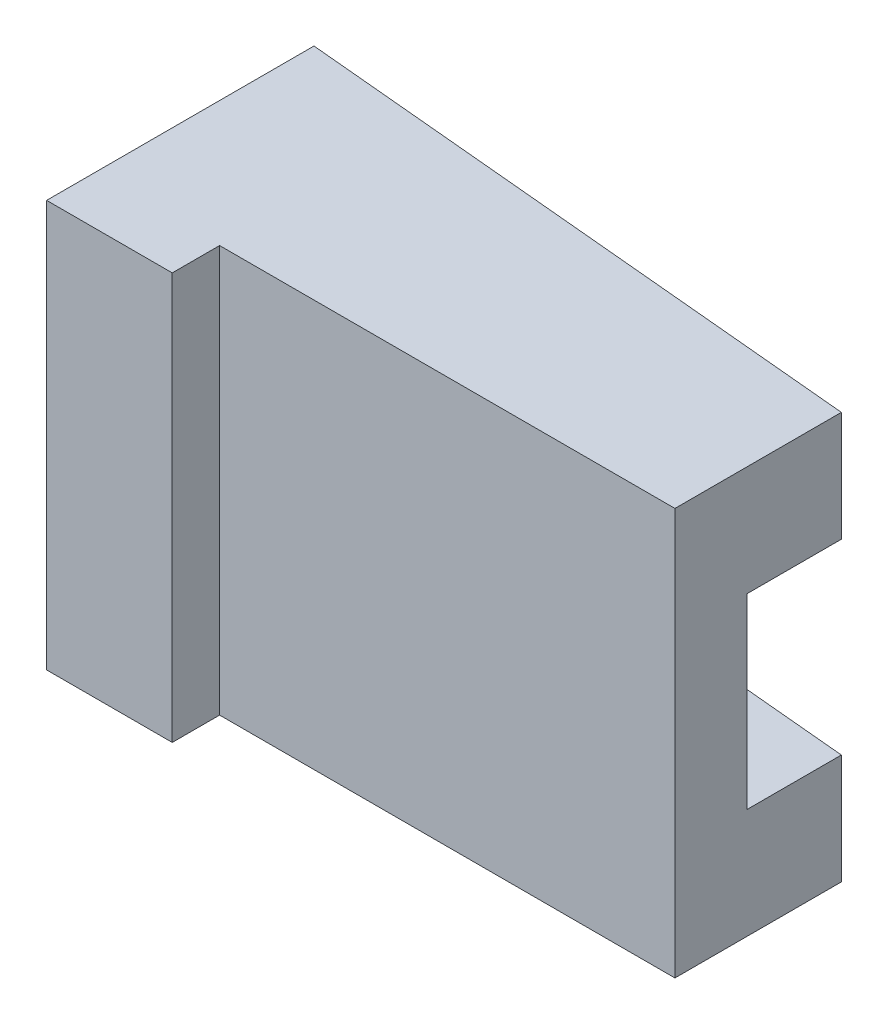
ISO-10303-21;
HEADER;
FILE_DESCRIPTION(('STEP AP214'),'2;1');
FILE_NAME('part.step','',(''),(''),'','','');
FILE_SCHEMA(('AUTOMOTIVE_DESIGN { 1 0 10303 214 1 1 1 1 }'));
ENDSEC;
DATA;
#1=APPLICATION_CONTEXT('core data for automotive mechanical design processes');
#2=APPLICATION_PROTOCOL_DEFINITION('international standard','automotive_design',2000,#1);
#3=PRODUCT_CONTEXT('',#1,'mechanical');
#4=PRODUCT('Part','Part','',(#3));
#5=PRODUCT_RELATED_PRODUCT_CATEGORY('part','',(#4));
#6=PRODUCT_DEFINITION_FORMATION('','',#4);
#7=PRODUCT_DEFINITION_CONTEXT('part definition',#1,'design');
#8=PRODUCT_DEFINITION('design','',#6,#7);
#9=PRODUCT_DEFINITION_SHAPE('','',#8);
#10=(LENGTH_UNIT() NAMED_UNIT(*) SI_UNIT(.MILLI.,.METRE.));
#11=(NAMED_UNIT(*) PLANE_ANGLE_UNIT() SI_UNIT($,.RADIAN.));
#12=(NAMED_UNIT(*) SI_UNIT($,.STERADIAN.) SOLID_ANGLE_UNIT());
#13=UNCERTAINTY_MEASURE_WITH_UNIT(LENGTH_MEASURE(1.E-05),#10,'distance_accuracy_value','');
#14=(GEOMETRIC_REPRESENTATION_CONTEXT(3) GLOBAL_UNCERTAINTY_ASSIGNED_CONTEXT((#13)) GLOBAL_UNIT_ASSIGNED_CONTEXT((#10,
#11,#12)) REPRESENTATION_CONTEXT('',''));
#15=CARTESIAN_POINT('',(0.,0.,0.));
#16=DIRECTION('',(0.,0.,1.));
#17=DIRECTION('',(1.,0.,0.));
#18=AXIS2_PLACEMENT_3D('',#15,#16,#17);
#19=CARTESIAN_POINT('',(-126.999964556229,-120.556177447376,-106.221518242105));
#20=DIRECTION('',(-1.,0.,0.));
#21=DIRECTION('',(0.,1.,0.));
#22=AXIS2_PLACEMENT_3D('',#19,#20,#21);
#23=CYLINDRICAL_SURFACE('',#22,2.05);
#24=CARTESIAN_POINT('',(-126.999964556229,-120.556177447376,-106.221518242105));
#25=DIRECTION('',(-1.,0.,0.));
#26=DIRECTION('',(0.,1.,0.));
#27=AXIS2_PLACEMENT_3D('',#24,#25,#26);
#28=CIRCLE('',#27,2.05);
#29=CARTESIAN_POINT('',(-126.999964556229,-122.606177447376,-106.221518242105));
#30=VERTEX_POINT('',#29);
#31=EDGE_CURVE('E205',#30,#30,#28,.T.);
#32=ORIENTED_EDGE('',*,*,#31,.T.);
#33=DIRECTION('',(1.,0.,0.));
#34=VECTOR('',#33,1.);
#35=CARTESIAN_POINT('',(-126.999964556229,-122.606177447376,-106.221518242105));
#36=LINE('',#35,#34);
#37=CARTESIAN_POINT('',(-115.999964556229,-122.606177447376,-106.221518242105));
#38=VERTEX_POINT('',#37);
#39=EDGE_CURVE('E11',#30,#38,#36,.T.);
#40=ORIENTED_EDGE('',*,*,#39,.T.);
#41=CARTESIAN_POINT('',(-115.999964556229,-120.556177447376,-106.221518242105));
#42=DIRECTION('',(-1.,0.,0.));
#43=DIRECTION('',(0.,1.,0.));
#44=AXIS2_PLACEMENT_3D('',#41,#42,#43);
#45=CIRCLE('',#44,2.05);
#46=EDGE_CURVE('E202',#38,#38,#45,.T.);
#47=ORIENTED_EDGE('',*,*,#46,.F.);
#48=ORIENTED_EDGE('',*,*,#39,.F.);
#49=EDGE_LOOP('',(#32,#40,#47,#48));
#50=FACE_BOUND('',#49,.T.);
#51=ADVANCED_FACE('F16',(#50),#23,.F.);
#52=CARTESIAN_POINT('',(-126.999964556229,-101.474691390343,-106.221518242105));
#53=DIRECTION('',(-1.,0.,0.));
#54=DIRECTION('',(0.,1.,0.));
#55=AXIS2_PLACEMENT_3D('',#52,#53,#54);
#56=CYLINDRICAL_SURFACE('',#55,2.05);
#57=CARTESIAN_POINT('',(-126.999964556229,-101.474691390343,-106.221518242105));
#58=DIRECTION('',(-1.,0.,0.));
#59=DIRECTION('',(0.,1.,0.));
#60=AXIS2_PLACEMENT_3D('',#57,#58,#59);
#61=CIRCLE('',#60,2.05);
#62=CARTESIAN_POINT('',(-126.999964556229,-103.524691390343,-106.221518242105));
#63=VERTEX_POINT('',#62);
#64=EDGE_CURVE('E208',#63,#63,#61,.T.);
#65=ORIENTED_EDGE('',*,*,#64,.T.);
#66=DIRECTION('',(1.,0.,0.));
#67=VECTOR('',#66,1.);
#68=CARTESIAN_POINT('',(-126.999964556229,-103.524691390343,-106.221518242105));
#69=LINE('',#68,#67);
#70=CARTESIAN_POINT('',(-115.999964556229,-103.524691390343,-106.221518242105));
#71=VERTEX_POINT('',#70);
#72=EDGE_CURVE('E27',#63,#71,#69,.T.);
#73=ORIENTED_EDGE('',*,*,#72,.T.);
#74=CARTESIAN_POINT('',(-115.999964556229,-101.474691390343,-106.221518242105));
#75=DIRECTION('',(-1.,0.,0.));
#76=DIRECTION('',(0.,1.,0.));
#77=AXIS2_PLACEMENT_3D('',#74,#75,#76);
#78=CIRCLE('',#77,2.05);
#79=EDGE_CURVE('E275',#71,#71,#78,.T.);
#80=ORIENTED_EDGE('',*,*,#79,.F.);
#81=ORIENTED_EDGE('',*,*,#72,.F.);
#82=EDGE_LOOP('',(#65,#73,#80,#81));
#83=FACE_BOUND('',#82,.T.);
#84=ADVANCED_FACE('F345',(#83),#56,.F.);
#85=CARTESIAN_POINT('',(-89.99996276809,-111.050046491209,-108.416206636852));
#86=DIRECTION('',(-1.,0.,0.));
#87=DIRECTION('',(0.,0.,1.));
#88=AXIS2_PLACEMENT_3D('',#85,#86,#87);
#89=PLANE('',#88);
#90=DIRECTION('',(0.,-1.,0.));
#91=VECTOR('',#90,1.);
#92=CARTESIAN_POINT('',(-89.99996276809,-124.000037425625,-110.916206636852));
#93=LINE('',#92,#91);
#94=CARTESIAN_POINT('',(-89.99996276809,-117.000055556792,-110.916206636852));
#95=VERTEX_POINT('',#94);
#96=CARTESIAN_POINT('',(-89.99996276809,-124.000037425625,-110.916206636852));
#97=VERTEX_POINT('',#96);
#98=EDGE_CURVE('E326',#95,#97,#93,.T.);
#99=ORIENTED_EDGE('',*,*,#98,.F.);
#100=DIRECTION('',(0.,0.,1.));
#101=VECTOR('',#100,1.);
#102=CARTESIAN_POINT('',(-89.99996276809,-117.000055556792,-111.800079289667));
#103=LINE('',#102,#101);
#104=CARTESIAN_POINT('',(-89.99996276809,-117.000055556792,-104.916206636852));
#105=VERTEX_POINT('',#104);
#106=EDGE_CURVE('E220',#95,#105,#103,.T.);
#107=ORIENTED_EDGE('',*,*,#106,.T.);
#108=DIRECTION('',(0.,-1.,0.));
#109=VECTOR('',#108,1.);
#110=CARTESIAN_POINT('',(-89.99996276809,-114.025051024,-104.916206636853));
#111=LINE('',#110,#109);
#112=CARTESIAN_POINT('',(-89.99996276809,-105.100055556792,-104.916206636852));
#113=VERTEX_POINT('',#112);
#114=EDGE_CURVE('E237',#113,#105,#111,.T.);
#115=ORIENTED_EDGE('',*,*,#114,.F.);
#116=DIRECTION('',(0.,0.,-1.));
#117=VECTOR('',#116,1.);
#118=CARTESIAN_POINT('',(-89.99996276809,-105.100055556792,-109.666206636853));
#119=LINE('',#118,#117);
#120=CARTESIAN_POINT('',(-89.99996276809,-105.100055556792,-110.916206636852));
#121=VERTEX_POINT('',#120);
#122=EDGE_CURVE('E212',#113,#121,#119,.T.);
#123=ORIENTED_EDGE('',*,*,#122,.T.);
#124=DIRECTION('',(0.,-1.,0.));
#125=VECTOR('',#124,1.);
#126=CARTESIAN_POINT('',(-89.99996276809,-104.100055556792,-110.916206636852));
#127=LINE('',#126,#125);
#128=CARTESIAN_POINT('',(-89.99996276809,-98.1000555567923,-110.916206636852));
#129=VERTEX_POINT('',#128);
#130=EDGE_CURVE('E209',#129,#121,#127,.T.);
#131=ORIENTED_EDGE('',*,*,#130,.F.);
#132=DIRECTION('',(0.,0.,1.));
#133=VECTOR('',#132,1.);
#134=CARTESIAN_POINT('',(-89.99996276809,-98.1000555567923,-105.916206636852));
#135=LINE('',#134,#133);
#136=CARTESIAN_POINT('',(-89.99996276809,-98.1000555567923,-100.316206636852));
#137=VERTEX_POINT('',#136);
#138=EDGE_CURVE('E188',#129,#137,#135,.T.);
#139=ORIENTED_EDGE('',*,*,#138,.T.);
#140=DIRECTION('',(0.,-1.,0.));
#141=VECTOR('',#140,1.);
#142=CARTESIAN_POINT('',(-89.99996276809,-98.1000555567923,-100.316206636852));
#143=LINE('',#142,#141);
#144=CARTESIAN_POINT('',(-89.99996276809,-124.000037425625,-100.316206636852));
#145=VERTEX_POINT('',#144);
#146=EDGE_CURVE('E167',#137,#145,#143,.T.);
#147=ORIENTED_EDGE('',*,*,#146,.T.);
#148=DIRECTION('',(0.,0.,1.));
#149=VECTOR('',#148,1.);
#150=CARTESIAN_POINT('',(-89.99996276809,-124.000037425625,-105.916206636852));
#151=LINE('',#150,#149);
#152=EDGE_CURVE('E286',#97,#145,#151,.T.);
#153=ORIENTED_EDGE('',*,*,#152,.F.);
#154=EDGE_LOOP('',(#99,#107,#115,#123,#131,#139,#147,#153));
#155=FACE_BOUND('',#154,.T.);
#156=ADVANCED_FACE('F18',(#155),#89,.F.);
#157=CARTESIAN_POINT('',(-146.99996276809,-124.000037425625,-97.3002066368526));
#158=DIRECTION('',(0.,0.,-1.));
#159=DIRECTION('',(0.,-1.,0.));
#160=AXIS2_PLACEMENT_3D('',#157,#158,#159);
#161=PLANE('',#160);
#162=DIRECTION('',(0.,1.,0.));
#163=VECTOR('',#162,1.);
#164=CARTESIAN_POINT('',(-126.999964556229,-117.525048920428,-97.3002066368525));
#165=LINE('',#164,#163);
#166=CARTESIAN_POINT('',(-126.999964556229,-124.000037425625,-97.3002066368526));
#167=VERTEX_POINT('',#166);
#168=CARTESIAN_POINT('',(-126.999964556229,-98.1000555567923,-97.3002066368526));
#169=VERTEX_POINT('',#168);
#170=EDGE_CURVE('E302',#167,#169,#165,.T.);
#171=ORIENTED_EDGE('',*,*,#170,.F.);
#172=DIRECTION('',(-1.,0.,0.));
#173=VECTOR('',#172,1.);
#174=CARTESIAN_POINT('',(-146.99996276809,-124.000037425625,-97.3002066368526));
#175=LINE('',#174,#173);
#176=CARTESIAN_POINT('',(-118.99996276809,-124.000037425625,-97.3002066368525));
#177=VERTEX_POINT('',#176);
#178=EDGE_CURVE('E180',#177,#167,#175,.T.);
#179=ORIENTED_EDGE('',*,*,#178,.F.);
#180=DIRECTION('',(0.,-1.,0.));
#181=VECTOR('',#180,1.);
#182=CARTESIAN_POINT('',(-118.99996276809,-98.1000555567923,-97.3002066368525));
#183=LINE('',#182,#181);
#184=CARTESIAN_POINT('',(-118.99996276809,-98.1000555567923,-97.3002066368525));
#185=VERTEX_POINT('',#184);
#186=EDGE_CURVE('E41',#185,#177,#183,.T.);
#187=ORIENTED_EDGE('',*,*,#186,.F.);
#188=DIRECTION('',(1.,0.,0.));
#189=VECTOR('',#188,1.);
#190=CARTESIAN_POINT('',(-146.99996276809,-98.1000555567923,-97.3002066368526));
#191=LINE('',#190,#189);
#192=EDGE_CURVE('E192',#169,#185,#191,.T.);
#193=ORIENTED_EDGE('',*,*,#192,.F.);
#194=EDGE_LOOP('',(#171,#179,#187,#193));
#195=FACE_BOUND('',#194,.T.);
#196=ADVANCED_FACE('F366',(#195),#161,.F.);
#197=CARTESIAN_POINT('',(-118.99996276809,-111.050046491209,-125.958103894729));
#198=DIRECTION('',(-1.,0.,0.));
#199=DIRECTION('',(0.,0.,1.));
#200=AXIS2_PLACEMENT_3D('',#197,#198,#199);
#201=PLANE('',#200);
#202=DIRECTION('',(0.,-1.,0.));
#203=VECTOR('',#202,1.);
#204=CARTESIAN_POINT('',(-118.99996276809,-117.525041958417,-100.316206636852));
#205=LINE('',#204,#203);
#206=CARTESIAN_POINT('',(-118.99996276809,-98.1000555567923,-100.316206636852));
#207=VERTEX_POINT('',#206);
#208=CARTESIAN_POINT('',(-118.99996276809,-124.000037425625,-100.316206636852));
#209=VERTEX_POINT('',#208);
#210=EDGE_CURVE('E171',#207,#209,#205,.T.);
#211=ORIENTED_EDGE('',*,*,#210,.F.);
#212=DIRECTION('',(0.,0.,1.));
#213=VECTOR('',#212,1.);
#214=CARTESIAN_POINT('',(-118.99996276809,-98.1000555567923,-102.916206636852));
#215=LINE('',#214,#213);
#216=EDGE_CURVE('E174',#207,#185,#215,.T.);
#217=ORIENTED_EDGE('',*,*,#216,.T.);
#218=ORIENTED_EDGE('',*,*,#186,.T.);
#219=DIRECTION('',(0.,0.,1.));
#220=VECTOR('',#219,1.);
#221=CARTESIAN_POINT('',(-118.99996276809,-124.000037425625,-102.916206636852));
#222=LINE('',#221,#220);
#223=EDGE_CURVE('E177',#209,#177,#222,.T.);
#224=ORIENTED_EDGE('',*,*,#223,.F.);
#225=EDGE_LOOP('',(#211,#217,#218,#224));
#226=FACE_BOUND('',#225,.T.);
#227=ADVANCED_FACE('F172',(#226),#201,.F.);
#228=CARTESIAN_POINT('',(-141.99996276809,-124.000037425625,-100.316206636852));
#229=DIRECTION('',(0.,0.,-1.));
#230=DIRECTION('',(0.,-1.,0.));
#231=AXIS2_PLACEMENT_3D('',#228,#229,#230);
#232=PLANE('',#231);
#233=ORIENTED_EDGE('',*,*,#210,.T.);
#234=DIRECTION('',(-1.,0.,0.));
#235=VECTOR('',#234,1.);
#236=CARTESIAN_POINT('',(-141.99996276809,-124.000037425625,-100.316206636852));
#237=LINE('',#236,#235);
#238=EDGE_CURVE('E279',#145,#209,#237,.T.);
#239=ORIENTED_EDGE('',*,*,#238,.F.);
#240=ORIENTED_EDGE('',*,*,#146,.F.);
#241=DIRECTION('',(1.,0.,0.));
#242=VECTOR('',#241,1.);
#243=CARTESIAN_POINT('',(-141.99996276809,-98.1000555567923,-100.316206636852));
#244=LINE('',#243,#242);
#245=EDGE_CURVE('E183',#207,#137,#244,.T.);
#246=ORIENTED_EDGE('',*,*,#245,.F.);
#247=EDGE_LOOP('',(#233,#239,#240,#246));
#248=FACE_BOUND('',#247,.T.);
#249=ADVANCED_FACE('F184',(#248),#232,.F.);
#250=CARTESIAN_POINT('',(-146.99996276809,-124.000037425625,-149.000001152606));
#251=DIRECTION('',(0.,1.,0.));
#252=DIRECTION('',(1.,0.,0.));
#253=AXIS2_PLACEMENT_3D('',#250,#251,#252);
#254=PLANE('',#253);
#255=DIRECTION('',(-0.995775852246426,0.,-0.0918174933381671));
#256=VECTOR('',#255,1.);
#257=CARTESIAN_POINT('',(-138.500689640032,-124.000037425625,-115.38831263984));
#258=LINE('',#257,#256);
#259=CARTESIAN_POINT('',(-126.999964556229,-124.000037425625,-114.32786540527));
#260=VERTEX_POINT('',#259);
#261=EDGE_CURVE('E158',#97,#260,#258,.T.);
#262=ORIENTED_EDGE('',*,*,#261,.F.);
#263=ORIENTED_EDGE('',*,*,#152,.T.);
#264=ORIENTED_EDGE('',*,*,#238,.T.);
#265=ORIENTED_EDGE('',*,*,#223,.T.);
#266=ORIENTED_EDGE('',*,*,#178,.T.);
#267=DIRECTION('',(0.,0.,-1.));
#268=VECTOR('',#267,1.);
#269=CARTESIAN_POINT('',(-126.999964556229,-124.000037425625,-137.479052523667));
#270=LINE('',#269,#268);
#271=EDGE_CURVE('E299',#167,#260,#270,.T.);
#272=ORIENTED_EDGE('',*,*,#271,.T.);
#273=EDGE_LOOP('',(#262,#263,#264,#265,#266,#272));
#274=FACE_BOUND('',#273,.T.);
#275=ADVANCED_FACE('F362',(#274),#254,.F.);
#276=CARTESIAN_POINT('',(-146.99996276809,-98.1000555567923,-102.916206636853));
#277=DIRECTION('',(0.,-1.,0.));
#278=DIRECTION('',(0.,0.,-1.));
#279=AXIS2_PLACEMENT_3D('',#276,#277,#278);
#280=PLANE('',#279);
#281=DIRECTION('',(0.995775852246426,0.,0.0918174933381671));
#282=VECTOR('',#281,1.);
#283=CARTESIAN_POINT('',(-136.393977207077,-98.1000555567923,-115.194059029108));
#284=LINE('',#283,#282);
#285=CARTESIAN_POINT('',(-126.999964556229,-98.1000555567923,-114.32786540527));
#286=VERTEX_POINT('',#285);
#287=EDGE_CURVE('E199',#286,#129,#284,.T.);
#288=ORIENTED_EDGE('',*,*,#287,.F.);
#289=DIRECTION('',(0.,0.,1.));
#290=VECTOR('',#289,1.);
#291=CARTESIAN_POINT('',(-126.999964556229,-98.1000555567923,-114.437155265791));
#292=LINE('',#291,#290);
#293=EDGE_CURVE('E251',#286,#169,#292,.T.);
#294=ORIENTED_EDGE('',*,*,#293,.T.);
#295=ORIENTED_EDGE('',*,*,#192,.T.);
#296=ORIENTED_EDGE('',*,*,#216,.F.);
#297=ORIENTED_EDGE('',*,*,#245,.T.);
#298=ORIENTED_EDGE('',*,*,#138,.F.);
#299=EDGE_LOOP('',(#288,#294,#295,#296,#297,#298));
#300=FACE_BOUND('',#299,.T.);
#301=ADVANCED_FACE('F190',(#300),#280,.F.);
#302=CARTESIAN_POINT('',(-126.999964556229,-98.1000555567923,-114.32786540527));
#303=DIRECTION('',(0.0918174933381671,0.,-0.995775852246426));
#304=DIRECTION('',(0.,-1.,0.));
#305=AXIS2_PLACEMENT_3D('',#302,#303,#304);
#306=PLANE('',#305);
#307=ORIENTED_EDGE('',*,*,#130,.T.);
#308=DIRECTION('',(-0.995775852246426,0.,-0.0918174933381671));
#309=VECTOR('',#308,1.);
#310=CARTESIAN_POINT('',(-126.688037814087,-105.100055556792,-114.2991035795));
#311=LINE('',#310,#309);
#312=CARTESIAN_POINT('',(-126.999964556229,-105.100055556792,-114.32786540527));
#313=VERTEX_POINT('',#312);
#314=EDGE_CURVE('E217',#121,#313,#311,.T.);
#315=ORIENTED_EDGE('',*,*,#314,.T.);
#316=DIRECTION('',(0.,-1.,0.));
#317=VECTOR('',#316,1.);
#318=CARTESIAN_POINT('',(-126.999964556229,-104.100037142503,-114.32786540527));
#319=LINE('',#318,#317);
#320=EDGE_CURVE('E82',#286,#313,#319,.T.);
#321=ORIENTED_EDGE('',*,*,#320,.F.);
#322=ORIENTED_EDGE('',*,*,#287,.T.);
#323=EDGE_LOOP('',(#307,#315,#321,#322));
#324=FACE_BOUND('',#323,.T.);
#325=ADVANCED_FACE('F384',(#324),#306,.T.);
#326=CARTESIAN_POINT('',(-126.999964556229,-98.1000555567923,-114.32786540527));
#327=DIRECTION('',(0.0918174933381671,0.,-0.995775852246426));
#328=DIRECTION('',(0.,-1.,0.));
#329=AXIS2_PLACEMENT_3D('',#326,#327,#328);
#330=PLANE('',#329);
#331=DIRECTION('',(0.,1.,0.));
#332=VECTOR('',#331,1.);
#333=CARTESIAN_POINT('',(-126.999964556229,-118.000055556792,-114.32786540527));
#334=LINE('',#333,#332);
#335=CARTESIAN_POINT('',(-126.999964556229,-117.000055556792,-114.32786540527));
#336=VERTEX_POINT('',#335);
#337=EDGE_CURVE('E303',#260,#336,#334,.T.);
#338=ORIENTED_EDGE('',*,*,#337,.T.);
#339=DIRECTION('',(0.995775852246426,0.,0.0918174933381671));
#340=VECTOR('',#339,1.);
#341=CARTESIAN_POINT('',(-126.543314738839,-117.000055556792,-114.285759100451));
#342=LINE('',#341,#340);
#343=EDGE_CURVE('E226',#336,#95,#342,.T.);
#344=ORIENTED_EDGE('',*,*,#343,.T.);
#345=ORIENTED_EDGE('',*,*,#98,.T.);
#346=ORIENTED_EDGE('',*,*,#261,.T.);
#347=EDGE_LOOP('',(#338,#344,#345,#346));
#348=FACE_BOUND('',#347,.T.);
#349=ADVANCED_FACE('F375',(#348),#330,.T.);
#350=CARTESIAN_POINT('',(-115.999964556229,-120.556177447376,-106.221518242105));
#351=DIRECTION('',(1.,0.,0.));
#352=DIRECTION('',(0.,1.,0.));
#353=AXIS2_PLACEMENT_3D('',#350,#351,#352);
#354=PLANE('',#353);
#355=ORIENTED_EDGE('',*,*,#46,.T.);
#356=EDGE_LOOP('',(#355));
#357=FACE_BOUND('',#356,.T.);
#358=ADVANCED_FACE('F372',(#357),#354,.F.);
#359=CARTESIAN_POINT('',(-115.999964556229,-101.474691390343,-106.221518242105));
#360=DIRECTION('',(1.,0.,0.));
#361=DIRECTION('',(0.,1.,0.));
#362=AXIS2_PLACEMENT_3D('',#359,#360,#361);
#363=PLANE('',#362);
#364=ORIENTED_EDGE('',*,*,#79,.T.);
#365=EDGE_LOOP('',(#364));
#366=FACE_BOUND('',#365,.T.);
#367=ADVANCED_FACE('F350',(#366),#363,.F.);
#368=CARTESIAN_POINT('',(-126.999964556229,-117.000037306416,-86.));
#369=DIRECTION('',(-1.,0.,0.));
#370=DIRECTION('',(0.,1.,0.));
#371=AXIS2_PLACEMENT_3D('',#368,#369,#370);
#372=PLANE('',#371);
#373=ORIENTED_EDGE('',*,*,#64,.F.);
#374=EDGE_LOOP('',(#373));
#375=FACE_BOUND('',#374,.T.);
#376=ORIENTED_EDGE('',*,*,#31,.F.);
#377=EDGE_LOOP('',(#376));
#378=FACE_BOUND('',#377,.T.);
#379=DIRECTION('',(0.,1.,0.));
#380=VECTOR('',#379,1.);
#381=CARTESIAN_POINT('',(-126.999964556229,-107.550046431604,-104.916206636853));
#382=LINE('',#381,#380);
#383=CARTESIAN_POINT('',(-126.999964556229,-117.000037306416,-104.916206636853));
#384=VERTEX_POINT('',#383);
#385=CARTESIAN_POINT('',(-126.999964556229,-105.100037142503,-104.916206636853));
#386=VERTEX_POINT('',#385);
#387=EDGE_CURVE('E94',#384,#386,#382,.T.);
#388=ORIENTED_EDGE('',*,*,#387,.F.);
#389=DIRECTION('',(0.,0.,-1.));
#390=VECTOR('',#389,1.);
#391=CARTESIAN_POINT('',(-126.999964556229,-117.000055556792,-100.591975971241));
#392=LINE('',#391,#390);
#393=CARTESIAN_POINT('',(-126.999964556229,-117.000037306416,-110.916206636853));
#394=VERTEX_POINT('',#393);
#395=EDGE_CURVE('E146',#384,#394,#392,.T.);
#396=ORIENTED_EDGE('',*,*,#395,.T.);
#397=DIRECTION('',(0.,0.,-1.));
#398=VECTOR('',#397,1.);
#399=CARTESIAN_POINT('',(-126.999964556229,-117.000055556792,-100.591975971241));
#400=LINE('',#399,#398);
#401=EDGE_CURVE('E221',#394,#336,#400,.T.);
#402=ORIENTED_EDGE('',*,*,#401,.T.);
#403=ORIENTED_EDGE('',*,*,#337,.F.);
#404=ORIENTED_EDGE('',*,*,#271,.F.);
#405=ORIENTED_EDGE('',*,*,#170,.T.);
#406=ORIENTED_EDGE('',*,*,#293,.F.);
#407=ORIENTED_EDGE('',*,*,#320,.T.);
#408=DIRECTION('',(0.,0.,1.));
#409=VECTOR('',#408,1.);
#410=CARTESIAN_POINT('',(-126.999964556229,-105.100055556792,-110.916206636853));
#411=LINE('',#410,#409);
#412=CARTESIAN_POINT('',(-126.999964556229,-105.100055556792,-110.916206636853));
#413=VERTEX_POINT('',#412);
#414=EDGE_CURVE('E20',#313,#413,#411,.T.);
#415=ORIENTED_EDGE('',*,*,#414,.T.);
#416=DIRECTION('',(0.,0.,1.));
#417=VECTOR('',#416,1.);
#418=CARTESIAN_POINT('',(-126.999964556229,-105.100055556792,-98.4581033184263));
#419=LINE('',#418,#417);
#420=EDGE_CURVE('E244',#413,#386,#419,.T.);
#421=ORIENTED_EDGE('',*,*,#420,.T.);
#422=EDGE_LOOP('',(#388,#396,#402,#403,#404,#405,#406,#407,#415,#421));
#423=FACE_BOUND('',#422,.T.);
#424=ADVANCED_FACE('F262',(#375,#378,#423),#372,.T.);
#425=CARTESIAN_POINT('',(-125.99996276809,-117.000055556792,-115.183951942483));
#426=DIRECTION('',(0.,-1.,0.));
#427=DIRECTION('',(0.,0.,-1.));
#428=AXIS2_PLACEMENT_3D('',#425,#426,#427);
#429=PLANE('',#428);
#430=ORIENTED_EDGE('',*,*,#343,.F.);
#431=ORIENTED_EDGE('',*,*,#401,.F.);
#432=ORIENTED_EDGE('',*,*,#395,.F.);
#433=DIRECTION('',(1.,0.,0.));
#434=VECTOR('',#433,1.);
#435=CARTESIAN_POINT('',(-133.99996276809,-117.000055556792,-104.916206636853));
#436=LINE('',#435,#434);
#437=EDGE_CURVE('E231',#384,#105,#436,.T.);
#438=ORIENTED_EDGE('',*,*,#437,.T.);
#439=ORIENTED_EDGE('',*,*,#106,.F.);
#440=EDGE_LOOP('',(#430,#431,#432,#438,#439));
#441=FACE_BOUND('',#440,.T.);
#442=ADVANCED_FACE('F349',(#441),#429,.F.);
#443=CARTESIAN_POINT('',(-141.99996276809,-98.1000555567923,-104.916206636853));
#444=DIRECTION('',(0.,0.,-1.));
#445=DIRECTION('',(0.,-1.,0.));
#446=AXIS2_PLACEMENT_3D('',#443,#444,#445);
#447=PLANE('',#446);
#448=DIRECTION('',(-1.,0.,0.));
#449=VECTOR('',#448,1.);
#450=CARTESIAN_POINT('',(-134.499963662159,-105.100055556792,-104.916206636853));
#451=LINE('',#450,#449);
#452=EDGE_CURVE('E216',#113,#386,#451,.T.);
#453=ORIENTED_EDGE('',*,*,#452,.F.);
#454=ORIENTED_EDGE('',*,*,#114,.T.);
#455=ORIENTED_EDGE('',*,*,#437,.F.);
#456=ORIENTED_EDGE('',*,*,#387,.T.);
#457=EDGE_LOOP('',(#453,#454,#455,#456));
#458=FACE_BOUND('',#457,.T.);
#459=ADVANCED_FACE('F267',(#458),#447,.T.);
#460=CARTESIAN_POINT('',(-126.999964556229,-105.100055556792,-110.916206636853));
#461=DIRECTION('',(0.,1.,0.));
#462=DIRECTION('',(1.,0.,0.));
#463=AXIS2_PLACEMENT_3D('',#460,#461,#462);
#464=PLANE('',#463);
#465=ORIENTED_EDGE('',*,*,#420,.F.);
#466=ORIENTED_EDGE('',*,*,#414,.F.);
#467=ORIENTED_EDGE('',*,*,#314,.F.);
#468=ORIENTED_EDGE('',*,*,#122,.F.);
#469=ORIENTED_EDGE('',*,*,#452,.T.);
#470=EDGE_LOOP('',(#465,#466,#467,#468,#469));
#471=FACE_BOUND('',#470,.T.);
#472=ADVANCED_FACE('F264',(#471),#464,.F.);
#473=CLOSED_SHELL('',(#51,#84,#156,#196,#227,#249,#275,#301,#325,#349,#358,#367,#424,#442,#459,#472));
#474=MANIFOLD_SOLID_BREP('B1',#473);
#475=ADVANCED_BREP_SHAPE_REPRESENTATION('',(#18,#474),#14);
#476=SHAPE_DEFINITION_REPRESENTATION(#9,#475);
ENDSEC;
END-ISO-10303-21;
